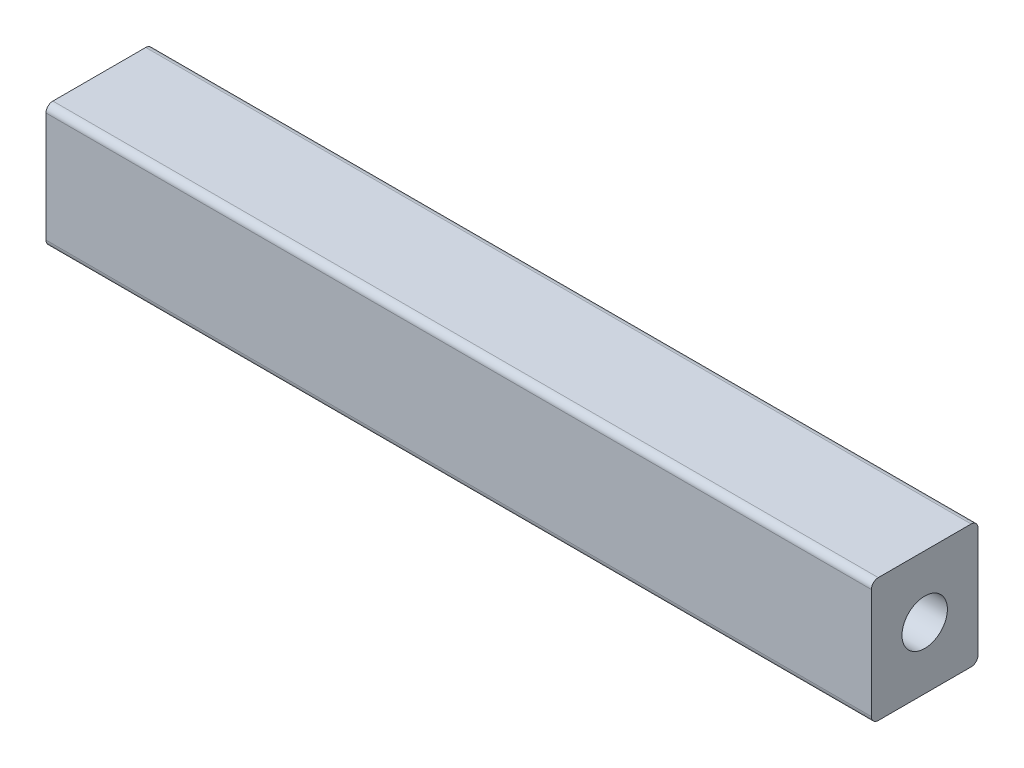
ISO-10303-21;
HEADER;
FILE_DESCRIPTION(('STEP AP214'),'2;1');
FILE_NAME('part.step','',(''),(''),'','','');
FILE_SCHEMA(('AUTOMOTIVE_DESIGN { 1 0 10303 214 1 1 1 1 }'));
ENDSEC;
DATA;
#1=APPLICATION_CONTEXT('core data for automotive mechanical design processes');
#2=APPLICATION_PROTOCOL_DEFINITION('international standard','automotive_design',2000,#1);
#3=PRODUCT_CONTEXT('',#1,'mechanical');
#4=PRODUCT('Part','Part','',(#3));
#5=PRODUCT_RELATED_PRODUCT_CATEGORY('part','',(#4));
#6=PRODUCT_DEFINITION_FORMATION('','',#4);
#7=PRODUCT_DEFINITION_CONTEXT('part definition',#1,'design');
#8=PRODUCT_DEFINITION('design','',#6,#7);
#9=PRODUCT_DEFINITION_SHAPE('','',#8);
#10=(LENGTH_UNIT() NAMED_UNIT(*) SI_UNIT(.MILLI.,.METRE.));
#11=(NAMED_UNIT(*) PLANE_ANGLE_UNIT() SI_UNIT($,.RADIAN.));
#12=(NAMED_UNIT(*) SI_UNIT($,.STERADIAN.) SOLID_ANGLE_UNIT());
#13=UNCERTAINTY_MEASURE_WITH_UNIT(LENGTH_MEASURE(1.E-05),#10,'distance_accuracy_value','');
#14=(GEOMETRIC_REPRESENTATION_CONTEXT(3) GLOBAL_UNCERTAINTY_ASSIGNED_CONTEXT((#13)) GLOBAL_UNIT_ASSIGNED_CONTEXT((#10,
#11,#12)) REPRESENTATION_CONTEXT('',''));
#15=CARTESIAN_POINT('',(0.,0.,0.));
#16=DIRECTION('',(0.,0.,1.));
#17=DIRECTION('',(1.,0.,0.));
#18=AXIS2_PLACEMENT_3D('',#15,#16,#17);
#19=CARTESIAN_POINT('',(60.,-9.,-7.74999999999999));
#20=DIRECTION('',(0.,0.,1.));
#21=DIRECTION('',(1.,0.,0.));
#22=AXIS2_PLACEMENT_3D('',#19,#20,#21);
#23=PLANE('',#22);
#24=DIRECTION('',(0.,1.,0.));
#25=VECTOR('',#24,1.);
#26=CARTESIAN_POINT('',(60.,-9.,-7.74999999999999));
#27=LINE('',#26,#25);
#28=CARTESIAN_POINT('',(60.,-8.,-7.74999999999999));
#29=VERTEX_POINT('',#28);
#30=CARTESIAN_POINT('',(60.,8.,-7.74999999999999));
#31=VERTEX_POINT('',#30);
#32=EDGE_CURVE('E141',#29,#31,#27,.T.);
#33=ORIENTED_EDGE('',*,*,#32,.F.);
#34=DIRECTION('',(-1.,0.,0.));
#35=VECTOR('',#34,1.);
#36=CARTESIAN_POINT('',(60.,-8.,-7.74999999999999));
#37=LINE('',#36,#35);
#38=CARTESIAN_POINT('',(-60.,-8.,-7.74999999999999));
#39=VERTEX_POINT('',#38);
#40=EDGE_CURVE('E209',#29,#39,#37,.T.);
#41=ORIENTED_EDGE('',*,*,#40,.T.);
#42=DIRECTION('',(0.,1.,0.));
#43=VECTOR('',#42,1.);
#44=CARTESIAN_POINT('',(-60.,-9.,-7.74999999999999));
#45=LINE('',#44,#43);
#46=CARTESIAN_POINT('',(-60.,8.,-7.74999999999999));
#47=VERTEX_POINT('',#46);
#48=EDGE_CURVE('E140',#39,#47,#45,.T.);
#49=ORIENTED_EDGE('',*,*,#48,.T.);
#50=DIRECTION('',(-1.,0.,0.));
#51=VECTOR('',#50,1.);
#52=CARTESIAN_POINT('',(60.,8.,-7.74999999999999));
#53=LINE('',#52,#51);
#54=EDGE_CURVE('E206',#47,#31,#53,.F.);
#55=ORIENTED_EDGE('',*,*,#54,.T.);
#56=EDGE_LOOP('',(#33,#41,#49,#55));
#57=FACE_BOUND('',#56,.T.);
#58=ADVANCED_FACE('F44',(#57),#23,.F.);
#59=CARTESIAN_POINT('',(60.,9.,7.75000000000001));
#60=DIRECTION('',(0.,-1.,0.));
#61=DIRECTION('',(0.,0.,-1.));
#62=AXIS2_PLACEMENT_3D('',#59,#60,#61);
#63=PLANE('',#62);
#64=DIRECTION('',(0.,0.,1.));
#65=VECTOR('',#64,1.);
#66=CARTESIAN_POINT('',(60.,9.,7.75000000000001));
#67=LINE('',#66,#65);
#68=CARTESIAN_POINT('',(60.,9.,-6.74999999999999));
#69=VERTEX_POINT('',#68);
#70=CARTESIAN_POINT('',(60.,9.,6.75000000000001));
#71=VERTEX_POINT('',#70);
#72=EDGE_CURVE('E144',#69,#71,#67,.T.);
#73=ORIENTED_EDGE('',*,*,#72,.F.);
#74=DIRECTION('',(-1.,0.,0.));
#75=VECTOR('',#74,1.);
#76=CARTESIAN_POINT('',(60.,9.,-6.74999999999999));
#77=LINE('',#76,#75);
#78=CARTESIAN_POINT('',(-60.,9.,-6.74999999999999));
#79=VERTEX_POINT('',#78);
#80=EDGE_CURVE('E11',#69,#79,#77,.T.);
#81=ORIENTED_EDGE('',*,*,#80,.T.);
#82=DIRECTION('',(0.,0.,1.));
#83=VECTOR('',#82,1.);
#84=CARTESIAN_POINT('',(-60.,9.,7.75000000000001));
#85=LINE('',#84,#83);
#86=CARTESIAN_POINT('',(-60.,9.,6.75000000000001));
#87=VERTEX_POINT('',#86);
#88=EDGE_CURVE('E160',#79,#87,#85,.T.);
#89=ORIENTED_EDGE('',*,*,#88,.T.);
#90=DIRECTION('',(-1.,0.,0.));
#91=VECTOR('',#90,1.);
#92=CARTESIAN_POINT('',(60.,9.,6.75000000000001));
#93=LINE('',#92,#91);
#94=EDGE_CURVE('E53',#87,#71,#93,.F.);
#95=ORIENTED_EDGE('',*,*,#94,.T.);
#96=EDGE_LOOP('',(#73,#81,#89,#95));
#97=FACE_BOUND('',#96,.T.);
#98=ADVANCED_FACE('F227',(#97),#63,.F.);
#99=CARTESIAN_POINT('',(60.,-9.,7.75000000000001));
#100=DIRECTION('',(0.,0.,-1.));
#101=DIRECTION('',(-1.,0.,0.));
#102=AXIS2_PLACEMENT_3D('',#99,#100,#101);
#103=PLANE('',#102);
#104=DIRECTION('',(0.,-1.,0.));
#105=VECTOR('',#104,1.);
#106=CARTESIAN_POINT('',(-60.,-9.,7.75000000000001));
#107=LINE('',#106,#105);
#108=CARTESIAN_POINT('',(-60.,8.,7.75000000000001));
#109=VERTEX_POINT('',#108);
#110=CARTESIAN_POINT('',(-60.,-8.,7.75000000000001));
#111=VERTEX_POINT('',#110);
#112=EDGE_CURVE('E163',#109,#111,#107,.T.);
#113=ORIENTED_EDGE('',*,*,#112,.T.);
#114=DIRECTION('',(-1.,0.,0.));
#115=VECTOR('',#114,1.);
#116=CARTESIAN_POINT('',(60.,-8.,7.75000000000001));
#117=LINE('',#116,#115);
#118=CARTESIAN_POINT('',(60.,-8.,7.75000000000001));
#119=VERTEX_POINT('',#118);
#120=EDGE_CURVE('E192',#111,#119,#117,.F.);
#121=ORIENTED_EDGE('',*,*,#120,.T.);
#122=DIRECTION('',(0.,-1.,0.));
#123=VECTOR('',#122,1.);
#124=CARTESIAN_POINT('',(60.,-9.,7.75000000000001));
#125=LINE('',#124,#123);
#126=CARTESIAN_POINT('',(60.,8.,7.75000000000001));
#127=VERTEX_POINT('',#126);
#128=EDGE_CURVE('E148',#127,#119,#125,.T.);
#129=ORIENTED_EDGE('',*,*,#128,.F.);
#130=DIRECTION('',(-1.,0.,0.));
#131=VECTOR('',#130,1.);
#132=CARTESIAN_POINT('',(60.,8.,7.75000000000001));
#133=LINE('',#132,#131);
#134=EDGE_CURVE('E188',#127,#109,#133,.T.);
#135=ORIENTED_EDGE('',*,*,#134,.T.);
#136=EDGE_LOOP('',(#113,#121,#129,#135));
#137=FACE_BOUND('',#136,.T.);
#138=ADVANCED_FACE('F235',(#137),#103,.F.);
#139=CARTESIAN_POINT('',(60.,-9.,7.75000000000001));
#140=DIRECTION('',(0.,1.,0.));
#141=DIRECTION('',(0.,0.,1.));
#142=AXIS2_PLACEMENT_3D('',#139,#140,#141);
#143=PLANE('',#142);
#144=DIRECTION('',(0.,0.,-1.));
#145=VECTOR('',#144,1.);
#146=CARTESIAN_POINT('',(60.,-9.,7.75000000000001));
#147=LINE('',#146,#145);
#148=CARTESIAN_POINT('',(60.,-9.,6.75000000000001));
#149=VERTEX_POINT('',#148);
#150=CARTESIAN_POINT('',(60.,-9.,-6.74999999999999));
#151=VERTEX_POINT('',#150);
#152=EDGE_CURVE('E152',#149,#151,#147,.T.);
#153=ORIENTED_EDGE('',*,*,#152,.F.);
#154=DIRECTION('',(-1.,0.,0.));
#155=VECTOR('',#154,1.);
#156=CARTESIAN_POINT('',(60.,-9.,6.75000000000001));
#157=LINE('',#156,#155);
#158=CARTESIAN_POINT('',(-60.,-9.,6.75000000000001));
#159=VERTEX_POINT('',#158);
#160=EDGE_CURVE('E172',#149,#159,#157,.T.);
#161=ORIENTED_EDGE('',*,*,#160,.T.);
#162=DIRECTION('',(0.,0.,-1.));
#163=VECTOR('',#162,1.);
#164=CARTESIAN_POINT('',(-60.,-9.,7.75000000000001));
#165=LINE('',#164,#163);
#166=CARTESIAN_POINT('',(-60.,-9.,-6.74999999999999));
#167=VERTEX_POINT('',#166);
#168=EDGE_CURVE('E145',#159,#167,#165,.T.);
#169=ORIENTED_EDGE('',*,*,#168,.T.);
#170=DIRECTION('',(-1.,0.,0.));
#171=VECTOR('',#170,1.);
#172=CARTESIAN_POINT('',(60.,-9.,-6.74999999999999));
#173=LINE('',#172,#171);
#174=EDGE_CURVE('E156',#167,#151,#173,.F.);
#175=ORIENTED_EDGE('',*,*,#174,.T.);
#176=EDGE_LOOP('',(#153,#161,#169,#175));
#177=FACE_BOUND('',#176,.T.);
#178=ADVANCED_FACE('F243',(#177),#143,.F.);
#179=CARTESIAN_POINT('',(60.,0.,0.));
#180=DIRECTION('',(-1.,0.,0.));
#181=DIRECTION('',(0.,0.,1.));
#182=AXIS2_PLACEMENT_3D('',#179,#180,#181);
#183=PLANE('',#182);
#184=CARTESIAN_POINT('',(60.,0.,0.));
#185=DIRECTION('',(1.,0.,0.));
#186=DIRECTION('',(0.,0.,-1.));
#187=AXIS2_PLACEMENT_3D('',#184,#185,#186);
#188=CIRCLE('',#187,3.3);
#189=CARTESIAN_POINT('',(60.,0.,-3.3));
#190=VERTEX_POINT('',#189);
#191=EDGE_CURVE('E126',#190,#190,#188,.T.);
#192=ORIENTED_EDGE('',*,*,#191,.F.);
#193=EDGE_LOOP('',(#192));
#194=FACE_BOUND('',#193,.T.);
#195=ORIENTED_EDGE('',*,*,#128,.T.);
#196=CARTESIAN_POINT('',(60.,-8.,6.75000000000001));
#197=DIRECTION('',(-1.,0.,0.));
#198=DIRECTION('',(0.,0.,1.));
#199=AXIS2_PLACEMENT_3D('',#196,#197,#198);
#200=CIRCLE('',#199,1.);
#201=EDGE_CURVE('E203',#119,#149,#200,.F.);
#202=ORIENTED_EDGE('',*,*,#201,.T.);
#203=ORIENTED_EDGE('',*,*,#152,.T.);
#204=CARTESIAN_POINT('',(60.,-8.,-6.74999999999999));
#205=DIRECTION('',(-1.,0.,0.));
#206=DIRECTION('',(0.,0.,1.));
#207=AXIS2_PLACEMENT_3D('',#204,#205,#206);
#208=CIRCLE('',#207,1.);
#209=EDGE_CURVE('E200',#151,#29,#208,.F.);
#210=ORIENTED_EDGE('',*,*,#209,.T.);
#211=ORIENTED_EDGE('',*,*,#32,.T.);
#212=CARTESIAN_POINT('',(60.,8.,-6.74999999999999));
#213=DIRECTION('',(-1.,0.,0.));
#214=DIRECTION('',(0.,0.,1.));
#215=AXIS2_PLACEMENT_3D('',#212,#213,#214);
#216=CIRCLE('',#215,1.);
#217=EDGE_CURVE('E66',#31,#69,#216,.F.);
#218=ORIENTED_EDGE('',*,*,#217,.T.);
#219=ORIENTED_EDGE('',*,*,#72,.T.);
#220=CARTESIAN_POINT('',(60.,8.,6.75000000000001));
#221=DIRECTION('',(-1.,0.,0.));
#222=DIRECTION('',(0.,0.,1.));
#223=AXIS2_PLACEMENT_3D('',#220,#221,#222);
#224=CIRCLE('',#223,1.);
#225=EDGE_CURVE('E195',#71,#127,#224,.F.);
#226=ORIENTED_EDGE('',*,*,#225,.T.);
#227=EDGE_LOOP('',(#195,#202,#203,#210,#211,#218,#219,#226));
#228=FACE_BOUND('',#227,.T.);
#229=ADVANCED_FACE('F229',(#194,#228),#183,.F.);
#230=CARTESIAN_POINT('',(-60.,0.,0.));
#231=DIRECTION('',(-1.,0.,0.));
#232=DIRECTION('',(0.,0.,1.));
#233=AXIS2_PLACEMENT_3D('',#230,#231,#232);
#234=PLANE('',#233);
#235=CARTESIAN_POINT('',(-60.,0.,0.));
#236=DIRECTION('',(-1.,0.,0.));
#237=DIRECTION('',(0.,0.,1.));
#238=AXIS2_PLACEMENT_3D('',#235,#236,#237);
#239=CIRCLE('',#238,3.3);
#240=CARTESIAN_POINT('',(-60.,0.,3.3));
#241=VERTEX_POINT('',#240);
#242=EDGE_CURVE('E127',#241,#241,#239,.T.);
#243=ORIENTED_EDGE('',*,*,#242,.F.);
#244=EDGE_LOOP('',(#243));
#245=FACE_BOUND('',#244,.T.);
#246=ORIENTED_EDGE('',*,*,#168,.F.);
#247=CARTESIAN_POINT('',(-60.,-8.,6.75000000000001));
#248=DIRECTION('',(-1.,0.,0.));
#249=DIRECTION('',(0.,0.,1.));
#250=AXIS2_PLACEMENT_3D('',#247,#248,#249);
#251=CIRCLE('',#250,1.);
#252=EDGE_CURVE('E185',#159,#111,#251,.T.);
#253=ORIENTED_EDGE('',*,*,#252,.T.);
#254=ORIENTED_EDGE('',*,*,#112,.F.);
#255=CARTESIAN_POINT('',(-60.,8.,6.75000000000001));
#256=DIRECTION('',(-1.,0.,0.));
#257=DIRECTION('',(0.,0.,1.));
#258=AXIS2_PLACEMENT_3D('',#255,#256,#257);
#259=CIRCLE('',#258,1.);
#260=EDGE_CURVE('E176',#109,#87,#259,.T.);
#261=ORIENTED_EDGE('',*,*,#260,.T.);
#262=ORIENTED_EDGE('',*,*,#88,.F.);
#263=CARTESIAN_POINT('',(-60.,8.,-6.74999999999999));
#264=DIRECTION('',(-1.,0.,0.));
#265=DIRECTION('',(0.,0.,1.));
#266=AXIS2_PLACEMENT_3D('',#263,#264,#265);
#267=CIRCLE('',#266,1.);
#268=EDGE_CURVE('E179',#79,#47,#267,.T.);
#269=ORIENTED_EDGE('',*,*,#268,.T.);
#270=ORIENTED_EDGE('',*,*,#48,.F.);
#271=CARTESIAN_POINT('',(-60.,-8.,-6.74999999999999));
#272=DIRECTION('',(-1.,0.,0.));
#273=DIRECTION('',(0.,0.,1.));
#274=AXIS2_PLACEMENT_3D('',#271,#272,#273);
#275=CIRCLE('',#274,1.);
#276=EDGE_CURVE('E182',#39,#167,#275,.T.);
#277=ORIENTED_EDGE('',*,*,#276,.T.);
#278=EDGE_LOOP('',(#246,#253,#254,#261,#262,#269,#270,#277));
#279=FACE_BOUND('',#278,.T.);
#280=ADVANCED_FACE('F222',(#245,#279),#234,.T.);
#281=CARTESIAN_POINT('',(60.,-8.,6.75000000000001));
#282=DIRECTION('',(-1.,0.,0.));
#283=DIRECTION('',(0.,0.,1.));
#284=AXIS2_PLACEMENT_3D('',#281,#282,#283);
#285=CYLINDRICAL_SURFACE('',#284,1.);
#286=ORIENTED_EDGE('',*,*,#201,.F.);
#287=ORIENTED_EDGE('',*,*,#120,.F.);
#288=ORIENTED_EDGE('',*,*,#252,.F.);
#289=ORIENTED_EDGE('',*,*,#160,.F.);
#290=EDGE_LOOP('',(#286,#287,#288,#289));
#291=FACE_BOUND('',#290,.T.);
#292=ADVANCED_FACE('F240',(#291),#285,.T.);
#293=CARTESIAN_POINT('',(60.,-8.,-6.74999999999999));
#294=DIRECTION('',(-1.,0.,0.));
#295=DIRECTION('',(0.,0.,1.));
#296=AXIS2_PLACEMENT_3D('',#293,#294,#295);
#297=CYLINDRICAL_SURFACE('',#296,1.);
#298=ORIENTED_EDGE('',*,*,#209,.F.);
#299=ORIENTED_EDGE('',*,*,#174,.F.);
#300=ORIENTED_EDGE('',*,*,#276,.F.);
#301=ORIENTED_EDGE('',*,*,#40,.F.);
#302=EDGE_LOOP('',(#298,#299,#300,#301));
#303=FACE_BOUND('',#302,.T.);
#304=ADVANCED_FACE('F245',(#303),#297,.T.);
#305=CARTESIAN_POINT('',(60.,8.,-6.74999999999999));
#306=DIRECTION('',(-1.,0.,0.));
#307=DIRECTION('',(0.,0.,1.));
#308=AXIS2_PLACEMENT_3D('',#305,#306,#307);
#309=CYLINDRICAL_SURFACE('',#308,1.);
#310=ORIENTED_EDGE('',*,*,#217,.F.);
#311=ORIENTED_EDGE('',*,*,#54,.F.);
#312=ORIENTED_EDGE('',*,*,#268,.F.);
#313=ORIENTED_EDGE('',*,*,#80,.F.);
#314=EDGE_LOOP('',(#310,#311,#312,#313));
#315=FACE_BOUND('',#314,.T.);
#316=ADVANCED_FACE('F226',(#315),#309,.T.);
#317=CARTESIAN_POINT('',(60.,8.,6.75000000000001));
#318=DIRECTION('',(-1.,0.,0.));
#319=DIRECTION('',(0.,0.,1.));
#320=AXIS2_PLACEMENT_3D('',#317,#318,#319);
#321=CYLINDRICAL_SURFACE('',#320,1.);
#322=ORIENTED_EDGE('',*,*,#225,.F.);
#323=ORIENTED_EDGE('',*,*,#94,.F.);
#324=ORIENTED_EDGE('',*,*,#260,.F.);
#325=ORIENTED_EDGE('',*,*,#134,.F.);
#326=EDGE_LOOP('',(#322,#323,#324,#325));
#327=FACE_BOUND('',#326,.T.);
#328=ADVANCED_FACE('F46',(#327),#321,.T.);
#329=CARTESIAN_POINT('',(48.,0.,0.));
#330=DIRECTION('',(1.,0.,0.));
#331=DIRECTION('',(0.,0.,-1.));
#332=AXIS2_PLACEMENT_3D('',#329,#330,#331);
#333=CONICAL_SURFACE('',#332,3.3,1.02974425867665);
#334=CARTESIAN_POINT('',(46.0171599572091,0.,0.));
#335=VERTEX_POINT('',#334);
#336=VERTEX_LOOP('',#335);
#337=FACE_BOUND('',#336,.T.);
#338=CARTESIAN_POINT('',(48.,0.,0.));
#339=DIRECTION('',(1.,0.,0.));
#340=DIRECTION('',(0.,0.,-1.));
#341=AXIS2_PLACEMENT_3D('',#338,#339,#340);
#342=CIRCLE('',#341,3.3);
#343=CARTESIAN_POINT('',(48.,0.,-3.3));
#344=VERTEX_POINT('',#343);
#345=EDGE_CURVE('E132',#344,#344,#342,.T.);
#346=ORIENTED_EDGE('',*,*,#345,.T.);
#347=EDGE_LOOP('',(#346));
#348=FACE_BOUND('',#347,.T.);
#349=ADVANCED_FACE('F270',(#337,#348),#333,.F.);
#350=CARTESIAN_POINT('',(60.,0.,0.));
#351=DIRECTION('',(1.,0.,0.));
#352=DIRECTION('',(0.,0.,-1.));
#353=AXIS2_PLACEMENT_3D('',#350,#351,#352);
#354=CYLINDRICAL_SURFACE('',#353,3.3);
#355=ORIENTED_EDGE('',*,*,#345,.F.);
#356=EDGE_LOOP('',(#355));
#357=FACE_BOUND('',#356,.T.);
#358=ORIENTED_EDGE('',*,*,#191,.T.);
#359=EDGE_LOOP('',(#358));
#360=FACE_BOUND('',#359,.T.);
#361=ADVANCED_FACE('F119',(#357,#360),#354,.F.);
#362=CARTESIAN_POINT('',(-48.,0.,0.));
#363=DIRECTION('',(-1.,0.,0.));
#364=DIRECTION('',(0.,0.,1.));
#365=AXIS2_PLACEMENT_3D('',#362,#363,#364);
#366=CONICAL_SURFACE('',#365,3.3,1.02974425867665);
#367=CARTESIAN_POINT('',(-46.0171599572091,0.,0.));
#368=VERTEX_POINT('',#367);
#369=VERTEX_LOOP('',#368);
#370=FACE_BOUND('',#369,.T.);
#371=CARTESIAN_POINT('',(-48.,0.,0.));
#372=DIRECTION('',(-1.,0.,0.));
#373=DIRECTION('',(0.,0.,1.));
#374=AXIS2_PLACEMENT_3D('',#371,#372,#373);
#375=CIRCLE('',#374,3.3);
#376=CARTESIAN_POINT('',(-48.,0.,3.3));
#377=VERTEX_POINT('',#376);
#378=EDGE_CURVE('E123',#377,#377,#375,.T.);
#379=ORIENTED_EDGE('',*,*,#378,.T.);
#380=EDGE_LOOP('',(#379));
#381=FACE_BOUND('',#380,.T.);
#382=ADVANCED_FACE('F115',(#370,#381),#366,.F.);
#383=CARTESIAN_POINT('',(-60.,0.,0.));
#384=DIRECTION('',(-1.,0.,0.));
#385=DIRECTION('',(0.,0.,1.));
#386=AXIS2_PLACEMENT_3D('',#383,#384,#385);
#387=CYLINDRICAL_SURFACE('',#386,3.3);
#388=ORIENTED_EDGE('',*,*,#378,.F.);
#389=EDGE_LOOP('',(#388));
#390=FACE_BOUND('',#389,.T.);
#391=ORIENTED_EDGE('',*,*,#242,.T.);
#392=EDGE_LOOP('',(#391));
#393=FACE_BOUND('',#392,.T.);
#394=ADVANCED_FACE('F118',(#390,#393),#387,.F.);
#395=CLOSED_SHELL('',(#58,#98,#138,#178,#229,#280,#292,#304,#316,#328,#349,#361,#382,#394));
#396=MANIFOLD_SOLID_BREP('B2',#395);
#397=ADVANCED_BREP_SHAPE_REPRESENTATION('',(#18,#396),#14);
#398=SHAPE_DEFINITION_REPRESENTATION(#9,#397);
ENDSEC;
END-ISO-10303-21;
